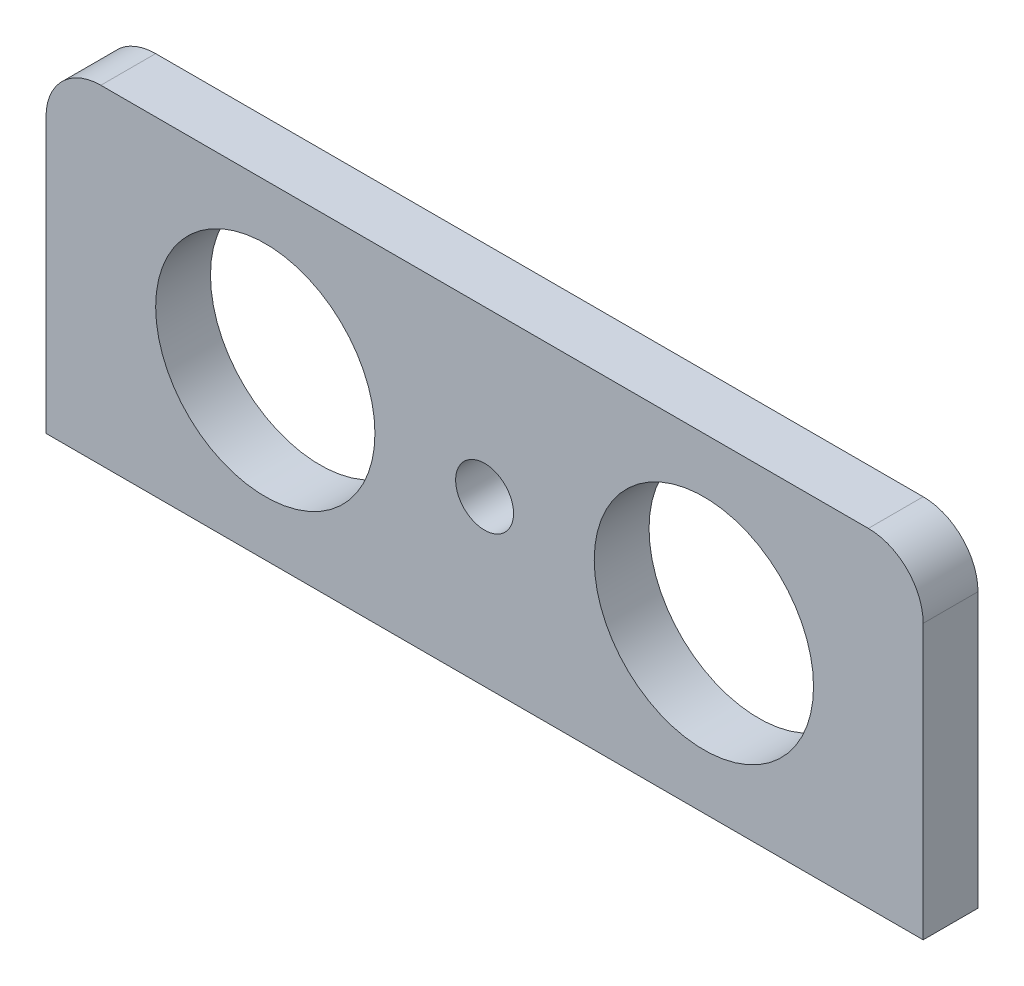
ISO-10303-21;
HEADER;
FILE_DESCRIPTION(('STEP AP214'),'2;1');
FILE_NAME('part.step','',(''),(''),'','','');
FILE_SCHEMA(('AUTOMOTIVE_DESIGN { 1 0 10303 214 1 1 1 1 }'));
ENDSEC;
DATA;
#1=APPLICATION_CONTEXT('core data for automotive mechanical design processes');
#2=APPLICATION_PROTOCOL_DEFINITION('international standard','automotive_design',2000,#1);
#3=PRODUCT_CONTEXT('',#1,'mechanical');
#4=PRODUCT('Part','Part','',(#3));
#5=PRODUCT_RELATED_PRODUCT_CATEGORY('part','',(#4));
#6=PRODUCT_DEFINITION_FORMATION('','',#4);
#7=PRODUCT_DEFINITION_CONTEXT('part definition',#1,'design');
#8=PRODUCT_DEFINITION('design','',#6,#7);
#9=PRODUCT_DEFINITION_SHAPE('','',#8);
#10=(LENGTH_UNIT() NAMED_UNIT(*) SI_UNIT(.MILLI.,.METRE.));
#11=(NAMED_UNIT(*) PLANE_ANGLE_UNIT() SI_UNIT($,.RADIAN.));
#12=(NAMED_UNIT(*) SI_UNIT($,.STERADIAN.) SOLID_ANGLE_UNIT());
#13=UNCERTAINTY_MEASURE_WITH_UNIT(LENGTH_MEASURE(1.E-05),#10,'distance_accuracy_value','');
#14=(GEOMETRIC_REPRESENTATION_CONTEXT(3) GLOBAL_UNCERTAINTY_ASSIGNED_CONTEXT((#13)) GLOBAL_UNIT_ASSIGNED_CONTEXT((#10,
#11,#12)) REPRESENTATION_CONTEXT('',''));
#15=CARTESIAN_POINT('',(0.,0.,0.));
#16=DIRECTION('',(0.,0.,1.));
#17=DIRECTION('',(1.,0.,0.));
#18=AXIS2_PLACEMENT_3D('',#15,#16,#17);
#19=CARTESIAN_POINT('',(0.,0.,5.));
#20=DIRECTION('',(0.,0.,1.));
#21=DIRECTION('',(1.,0.,0.));
#22=AXIS2_PLACEMENT_3D('',#19,#20,#21);
#23=PLANE('',#22);
#24=CARTESIAN_POINT('',(20.6188171074854,-21.917958991547,5.));
#25=DIRECTION('',(0.,0.,1.));
#26=DIRECTION('',(1.,0.,0.));
#27=AXIS2_PLACEMENT_3D('',#24,#25,#26);
#28=CIRCLE('',#27,10.);
#29=CARTESIAN_POINT('',(30.6188171074854,-21.917958991547,5.));
#30=VERTEX_POINT('',#29);
#31=EDGE_CURVE('E153',#30,#30,#28,.T.);
#32=ORIENTED_EDGE('',*,*,#31,.F.);
#33=EDGE_LOOP('',(#32));
#34=FACE_BOUND('',#33,.T.);
#35=DIRECTION('',(-1.,0.,0.));
#36=VECTOR('',#35,1.);
#37=CARTESIAN_POINT('',(-39.3811828925146,-6.91795899154697,5.));
#38=LINE('',#37,#36);
#39=CARTESIAN_POINT('',(35.6188171074854,-6.91795899154696,5.));
#40=VERTEX_POINT('',#39);
#41=CARTESIAN_POINT('',(-34.3811828925146,-6.91795899154697,5.));
#42=VERTEX_POINT('',#41);
#43=EDGE_CURVE('E119',#40,#42,#38,.T.);
#44=ORIENTED_EDGE('',*,*,#43,.T.);
#45=CARTESIAN_POINT('',(-34.3811828925146,-11.917958991547,5.));
#46=DIRECTION('',(0.,0.,1.));
#47=DIRECTION('',(1.,0.,0.));
#48=AXIS2_PLACEMENT_3D('',#45,#46,#47);
#49=CIRCLE('',#48,5.);
#50=CARTESIAN_POINT('',(-39.3811828925146,-11.917958991547,5.));
#51=VERTEX_POINT('',#50);
#52=EDGE_CURVE('E45',#42,#51,#49,.T.);
#53=ORIENTED_EDGE('',*,*,#52,.T.);
#54=DIRECTION('',(0.,-1.,0.));
#55=VECTOR('',#54,1.);
#56=CARTESIAN_POINT('',(-39.3811828925146,-6.91795899154697,5.));
#57=LINE('',#56,#55);
#58=CARTESIAN_POINT('',(-39.3811828925146,-36.917958991547,5.));
#59=VERTEX_POINT('',#58);
#60=EDGE_CURVE('E91',#51,#59,#57,.T.);
#61=ORIENTED_EDGE('',*,*,#60,.T.);
#62=DIRECTION('',(1.,0.,0.));
#63=VECTOR('',#62,1.);
#64=CARTESIAN_POINT('',(-39.3811828925146,-36.917958991547,5.));
#65=LINE('',#64,#63);
#66=CARTESIAN_POINT('',(40.6188171074854,-36.917958991547,5.));
#67=VERTEX_POINT('',#66);
#68=EDGE_CURVE('E94',#59,#67,#65,.T.);
#69=ORIENTED_EDGE('',*,*,#68,.T.);
#70=DIRECTION('',(0.,1.,0.));
#71=VECTOR('',#70,1.);
#72=CARTESIAN_POINT('',(40.6188171074854,-6.91795899154696,5.));
#73=LINE('',#72,#71);
#74=CARTESIAN_POINT('',(40.6188171074854,-11.917958991547,5.));
#75=VERTEX_POINT('',#74);
#76=EDGE_CURVE('E109',#67,#75,#73,.T.);
#77=ORIENTED_EDGE('',*,*,#76,.T.);
#78=CARTESIAN_POINT('',(35.6188171074854,-11.917958991547,5.));
#79=DIRECTION('',(0.,0.,1.));
#80=DIRECTION('',(1.,0.,0.));
#81=AXIS2_PLACEMENT_3D('',#78,#79,#80);
#82=CIRCLE('',#81,5.);
#83=EDGE_CURVE('E130',#75,#40,#82,.T.);
#84=ORIENTED_EDGE('',*,*,#83,.T.);
#85=EDGE_LOOP('',(#44,#53,#61,#69,#77,#84));
#86=FACE_BOUND('',#85,.T.);
#87=CARTESIAN_POINT('',(-19.3811828925146,-21.917958991547,5.));
#88=DIRECTION('',(0.,0.,1.));
#89=DIRECTION('',(1.,0.,0.));
#90=AXIS2_PLACEMENT_3D('',#87,#88,#89);
#91=CIRCLE('',#90,10.);
#92=CARTESIAN_POINT('',(-9.38118289251462,-21.917958991547,5.));
#93=VERTEX_POINT('',#92);
#94=EDGE_CURVE('E147',#93,#93,#91,.T.);
#95=ORIENTED_EDGE('',*,*,#94,.F.);
#96=EDGE_LOOP('',(#95));
#97=FACE_BOUND('',#96,.T.);
#98=CARTESIAN_POINT('',(0.618817107485372,-21.917958991547,5.));
#99=DIRECTION('',(0.,0.,1.));
#100=DIRECTION('',(1.,0.,0.));
#101=AXIS2_PLACEMENT_3D('',#98,#99,#100);
#102=CIRCLE('',#101,2.64104353572708);
#103=CARTESIAN_POINT('',(3.25986064321245,-21.917958991547,5.));
#104=VERTEX_POINT('',#103);
#105=EDGE_CURVE('E159',#104,#104,#102,.T.);
#106=ORIENTED_EDGE('',*,*,#105,.F.);
#107=EDGE_LOOP('',(#106));
#108=FACE_BOUND('',#107,.T.);
#109=ADVANCED_FACE('F37',(#34,#86,#97,#108),#23,.T.);
#110=CARTESIAN_POINT('',(0.,0.,0.));
#111=DIRECTION('',(0.,0.,1.));
#112=DIRECTION('',(1.,0.,0.));
#113=AXIS2_PLACEMENT_3D('',#110,#111,#112);
#114=PLANE('',#113);
#115=DIRECTION('',(0.,-1.,0.));
#116=VECTOR('',#115,1.);
#117=CARTESIAN_POINT('',(-39.3811828925146,-6.91795899154697,0.));
#118=LINE('',#117,#116);
#119=CARTESIAN_POINT('',(-39.3811828925146,-11.917958991547,0.));
#120=VERTEX_POINT('',#119);
#121=CARTESIAN_POINT('',(-39.3811828925146,-36.917958991547,0.));
#122=VERTEX_POINT('',#121);
#123=EDGE_CURVE('E113',#120,#122,#118,.T.);
#124=ORIENTED_EDGE('',*,*,#123,.F.);
#125=CARTESIAN_POINT('',(-34.3811828925146,-11.917958991547,0.));
#126=DIRECTION('',(0.,0.,1.));
#127=DIRECTION('',(1.,0.,0.));
#128=AXIS2_PLACEMENT_3D('',#125,#126,#127);
#129=CIRCLE('',#128,5.);
#130=CARTESIAN_POINT('',(-34.3811828925146,-6.91795899154697,0.));
#131=VERTEX_POINT('',#130);
#132=EDGE_CURVE('E124',#120,#131,#129,.F.);
#133=ORIENTED_EDGE('',*,*,#132,.T.);
#134=DIRECTION('',(-1.,0.,0.));
#135=VECTOR('',#134,1.);
#136=CARTESIAN_POINT('',(-39.3811828925146,-6.91795899154697,0.));
#137=LINE('',#136,#135);
#138=CARTESIAN_POINT('',(35.6188171074854,-6.91795899154696,0.));
#139=VERTEX_POINT('',#138);
#140=EDGE_CURVE('E101',#139,#131,#137,.T.);
#141=ORIENTED_EDGE('',*,*,#140,.F.);
#142=CARTESIAN_POINT('',(35.6188171074854,-11.917958991547,0.));
#143=DIRECTION('',(0.,0.,1.));
#144=DIRECTION('',(1.,0.,0.));
#145=AXIS2_PLACEMENT_3D('',#142,#143,#144);
#146=CIRCLE('',#145,5.);
#147=CARTESIAN_POINT('',(40.6188171074854,-11.917958991547,0.));
#148=VERTEX_POINT('',#147);
#149=EDGE_CURVE('E117',#139,#148,#146,.F.);
#150=ORIENTED_EDGE('',*,*,#149,.T.);
#151=DIRECTION('',(0.,1.,0.));
#152=VECTOR('',#151,1.);
#153=CARTESIAN_POINT('',(40.6188171074854,-6.91795899154696,0.));
#154=LINE('',#153,#152);
#155=CARTESIAN_POINT('',(40.6188171074854,-36.917958991547,0.));
#156=VERTEX_POINT('',#155);
#157=EDGE_CURVE('E141',#156,#148,#154,.T.);
#158=ORIENTED_EDGE('',*,*,#157,.F.);
#159=DIRECTION('',(1.,0.,0.));
#160=VECTOR('',#159,1.);
#161=CARTESIAN_POINT('',(-39.3811828925146,-36.917958991547,0.));
#162=LINE('',#161,#160);
#163=EDGE_CURVE('E143',#122,#156,#162,.T.);
#164=ORIENTED_EDGE('',*,*,#163,.F.);
#165=EDGE_LOOP('',(#124,#133,#141,#150,#158,#164));
#166=FACE_BOUND('',#165,.T.);
#167=CARTESIAN_POINT('',(-19.3811828925146,-21.917958991547,0.));
#168=DIRECTION('',(0.,0.,1.));
#169=DIRECTION('',(1.,0.,0.));
#170=AXIS2_PLACEMENT_3D('',#167,#168,#169);
#171=CIRCLE('',#170,10.);
#172=CARTESIAN_POINT('',(-9.38118289251462,-21.917958991547,0.));
#173=VERTEX_POINT('',#172);
#174=EDGE_CURVE('E150',#173,#173,#171,.T.);
#175=ORIENTED_EDGE('',*,*,#174,.T.);
#176=EDGE_LOOP('',(#175));
#177=FACE_BOUND('',#176,.T.);
#178=CARTESIAN_POINT('',(20.6188171074854,-21.917958991547,0.));
#179=DIRECTION('',(0.,0.,1.));
#180=DIRECTION('',(1.,0.,0.));
#181=AXIS2_PLACEMENT_3D('',#178,#179,#180);
#182=CIRCLE('',#181,10.);
#183=CARTESIAN_POINT('',(30.6188171074854,-21.917958991547,0.));
#184=VERTEX_POINT('',#183);
#185=EDGE_CURVE('E156',#184,#184,#182,.T.);
#186=ORIENTED_EDGE('',*,*,#185,.T.);
#187=EDGE_LOOP('',(#186));
#188=FACE_BOUND('',#187,.T.);
#189=CARTESIAN_POINT('',(0.618817107485372,-21.917958991547,0.));
#190=DIRECTION('',(0.,0.,1.));
#191=DIRECTION('',(1.,0.,0.));
#192=AXIS2_PLACEMENT_3D('',#189,#190,#191);
#193=CIRCLE('',#192,2.64104353572708);
#194=CARTESIAN_POINT('',(3.25986064321245,-21.917958991547,0.));
#195=VERTEX_POINT('',#194);
#196=EDGE_CURVE('E162',#195,#195,#193,.T.);
#197=ORIENTED_EDGE('',*,*,#196,.T.);
#198=EDGE_LOOP('',(#197));
#199=FACE_BOUND('',#198,.T.);
#200=ADVANCED_FACE('F139',(#166,#177,#188,#199),#114,.F.);
#201=CARTESIAN_POINT('',(-39.3811828925146,-6.91795899154697,5.));
#202=DIRECTION('',(1.,0.,0.));
#203=DIRECTION('',(0.,1.,0.));
#204=AXIS2_PLACEMENT_3D('',#201,#202,#203);
#205=PLANE('',#204);
#206=ORIENTED_EDGE('',*,*,#60,.F.);
#207=DIRECTION('',(0.,0.,-1.));
#208=VECTOR('',#207,1.);
#209=CARTESIAN_POINT('',(-39.3811828925146,-11.917958991547,5.));
#210=LINE('',#209,#208);
#211=EDGE_CURVE('E115',#51,#120,#210,.T.);
#212=ORIENTED_EDGE('',*,*,#211,.T.);
#213=ORIENTED_EDGE('',*,*,#123,.T.);
#214=DIRECTION('',(0.,0.,-1.));
#215=VECTOR('',#214,1.);
#216=CARTESIAN_POINT('',(-39.3811828925146,-36.917958991547,5.));
#217=LINE('',#216,#215);
#218=EDGE_CURVE('E106',#59,#122,#217,.T.);
#219=ORIENTED_EDGE('',*,*,#218,.F.);
#220=EDGE_LOOP('',(#206,#212,#213,#219));
#221=FACE_BOUND('',#220,.T.);
#222=ADVANCED_FACE('F111',(#221),#205,.F.);
#223=CARTESIAN_POINT('',(-39.3811828925146,-36.917958991547,5.));
#224=DIRECTION('',(0.,1.,0.));
#225=DIRECTION('',(0.,0.,1.));
#226=AXIS2_PLACEMENT_3D('',#223,#224,#225);
#227=PLANE('',#226);
#228=ORIENTED_EDGE('',*,*,#163,.T.);
#229=DIRECTION('',(0.,0.,-1.));
#230=VECTOR('',#229,1.);
#231=CARTESIAN_POINT('',(40.6188171074854,-36.917958991547,5.));
#232=LINE('',#231,#230);
#233=EDGE_CURVE('E108',#67,#156,#232,.T.);
#234=ORIENTED_EDGE('',*,*,#233,.F.);
#235=ORIENTED_EDGE('',*,*,#68,.F.);
#236=ORIENTED_EDGE('',*,*,#218,.T.);
#237=EDGE_LOOP('',(#228,#234,#235,#236));
#238=FACE_BOUND('',#237,.T.);
#239=ADVANCED_FACE('F105',(#238),#227,.F.);
#240=CARTESIAN_POINT('',(40.6188171074854,-6.91795899154696,5.));
#241=DIRECTION('',(-1.,0.,0.));
#242=DIRECTION('',(0.,-1.,0.));
#243=AXIS2_PLACEMENT_3D('',#240,#241,#242);
#244=PLANE('',#243);
#245=ORIENTED_EDGE('',*,*,#157,.T.);
#246=DIRECTION('',(0.,0.,-1.));
#247=VECTOR('',#246,1.);
#248=CARTESIAN_POINT('',(40.6188171074854,-11.917958991547,5.));
#249=LINE('',#248,#247);
#250=EDGE_CURVE('E11',#148,#75,#249,.F.);
#251=ORIENTED_EDGE('',*,*,#250,.T.);
#252=ORIENTED_EDGE('',*,*,#76,.F.);
#253=ORIENTED_EDGE('',*,*,#233,.T.);
#254=EDGE_LOOP('',(#245,#251,#252,#253));
#255=FACE_BOUND('',#254,.T.);
#256=ADVANCED_FACE('F142',(#255),#244,.F.);
#257=CARTESIAN_POINT('',(-39.3811828925146,-6.91795899154697,5.));
#258=DIRECTION('',(0.,-1.,0.));
#259=DIRECTION('',(1.,0.,0.));
#260=AXIS2_PLACEMENT_3D('',#257,#258,#259);
#261=PLANE('',#260);
#262=ORIENTED_EDGE('',*,*,#140,.T.);
#263=DIRECTION('',(0.,0.,-1.));
#264=VECTOR('',#263,1.);
#265=CARTESIAN_POINT('',(-34.3811828925146,-6.91795899154697,5.));
#266=LINE('',#265,#264);
#267=EDGE_CURVE('E58',#131,#42,#266,.F.);
#268=ORIENTED_EDGE('',*,*,#267,.T.);
#269=ORIENTED_EDGE('',*,*,#43,.F.);
#270=DIRECTION('',(0.,0.,-1.));
#271=VECTOR('',#270,1.);
#272=CARTESIAN_POINT('',(35.6188171074854,-6.91795899154696,5.));
#273=LINE('',#272,#271);
#274=EDGE_CURVE('E126',#40,#139,#273,.T.);
#275=ORIENTED_EDGE('',*,*,#274,.T.);
#276=EDGE_LOOP('',(#262,#268,#269,#275));
#277=FACE_BOUND('',#276,.T.);
#278=ADVANCED_FACE('F134',(#277),#261,.F.);
#279=CARTESIAN_POINT('',(-19.3811828925146,-21.917958991547,5.));
#280=DIRECTION('',(0.,0.,-1.));
#281=DIRECTION('',(-1.,0.,0.));
#282=AXIS2_PLACEMENT_3D('',#279,#280,#281);
#283=CYLINDRICAL_SURFACE('',#282,10.);
#284=ORIENTED_EDGE('',*,*,#94,.T.);
#285=EDGE_LOOP('',(#284));
#286=FACE_BOUND('',#285,.T.);
#287=ORIENTED_EDGE('',*,*,#174,.F.);
#288=EDGE_LOOP('',(#287));
#289=FACE_BOUND('',#288,.T.);
#290=ADVANCED_FACE('F180',(#286,#289),#283,.F.);
#291=CARTESIAN_POINT('',(20.6188171074854,-21.917958991547,5.));
#292=DIRECTION('',(0.,0.,-1.));
#293=DIRECTION('',(-1.,0.,0.));
#294=AXIS2_PLACEMENT_3D('',#291,#292,#293);
#295=CYLINDRICAL_SURFACE('',#294,10.);
#296=ORIENTED_EDGE('',*,*,#31,.T.);
#297=EDGE_LOOP('',(#296));
#298=FACE_BOUND('',#297,.T.);
#299=ORIENTED_EDGE('',*,*,#185,.F.);
#300=EDGE_LOOP('',(#299));
#301=FACE_BOUND('',#300,.T.);
#302=ADVANCED_FACE('F197',(#298,#301),#295,.F.);
#303=CARTESIAN_POINT('',(0.618817107485372,-21.917958991547,5.));
#304=DIRECTION('',(0.,0.,-1.));
#305=DIRECTION('',(-1.,0.,0.));
#306=AXIS2_PLACEMENT_3D('',#303,#304,#305);
#307=CYLINDRICAL_SURFACE('',#306,2.64104353572708);
#308=ORIENTED_EDGE('',*,*,#105,.T.);
#309=EDGE_LOOP('',(#308));
#310=FACE_BOUND('',#309,.T.);
#311=ORIENTED_EDGE('',*,*,#196,.F.);
#312=EDGE_LOOP('',(#311));
#313=FACE_BOUND('',#312,.T.);
#314=ADVANCED_FACE('F168',(#310,#313),#307,.F.);
#315=CARTESIAN_POINT('',(-34.3811828925146,-11.917958991547,5.));
#316=DIRECTION('',(0.,0.,-1.));
#317=DIRECTION('',(-1.,0.,0.));
#318=AXIS2_PLACEMENT_3D('',#315,#316,#317);
#319=CYLINDRICAL_SURFACE('',#318,5.);
#320=ORIENTED_EDGE('',*,*,#52,.F.);
#321=ORIENTED_EDGE('',*,*,#267,.F.);
#322=ORIENTED_EDGE('',*,*,#132,.F.);
#323=ORIENTED_EDGE('',*,*,#211,.F.);
#324=EDGE_LOOP('',(#320,#321,#322,#323));
#325=FACE_BOUND('',#324,.T.);
#326=ADVANCED_FACE('F190',(#325),#319,.T.);
#327=CARTESIAN_POINT('',(35.6188171074854,-11.917958991547,5.));
#328=DIRECTION('',(0.,0.,-1.));
#329=DIRECTION('',(-1.,0.,0.));
#330=AXIS2_PLACEMENT_3D('',#327,#328,#329);
#331=CYLINDRICAL_SURFACE('',#330,5.);
#332=ORIENTED_EDGE('',*,*,#83,.F.);
#333=ORIENTED_EDGE('',*,*,#250,.F.);
#334=ORIENTED_EDGE('',*,*,#149,.F.);
#335=ORIENTED_EDGE('',*,*,#274,.F.);
#336=EDGE_LOOP('',(#332,#333,#334,#335));
#337=FACE_BOUND('',#336,.T.);
#338=ADVANCED_FACE('F39',(#337),#331,.T.);
#339=CLOSED_SHELL('',(#109,#200,#222,#239,#256,#278,#290,#302,#314,#326,#338));
#340=MANIFOLD_SOLID_BREP('B2',#339);
#341=ADVANCED_BREP_SHAPE_REPRESENTATION('',(#18,#340),#14);
#342=SHAPE_DEFINITION_REPRESENTATION(#9,#341);
ENDSEC;
END-ISO-10303-21;
